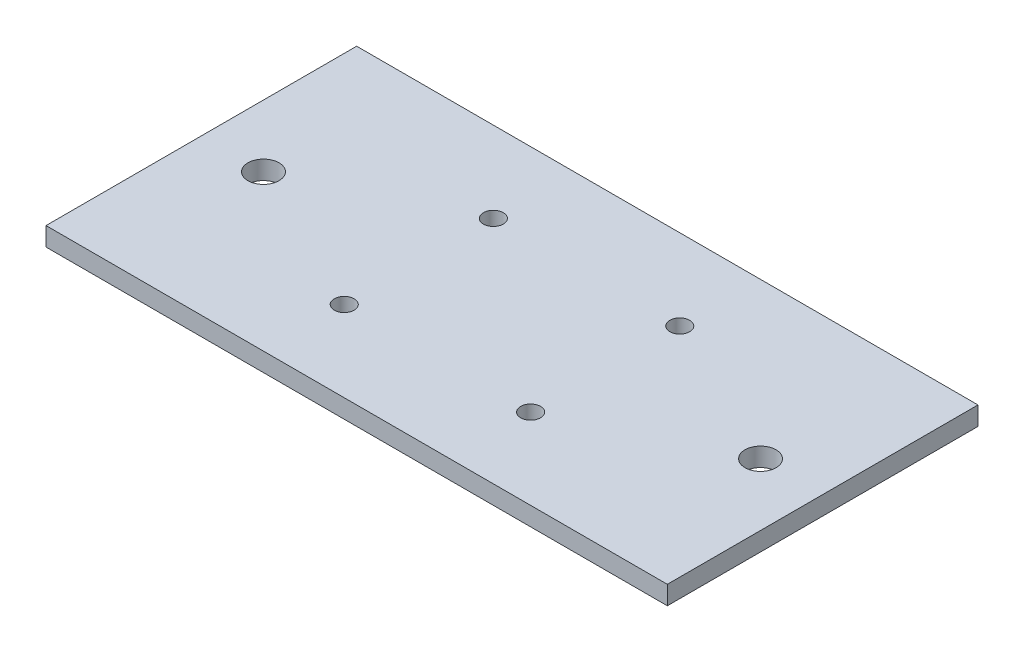
ISO-10303-21;
HEADER;
FILE_DESCRIPTION(('STEP AP214'),'2;1');
FILE_NAME('part.step','',(''),(''),'','','');
FILE_SCHEMA(('AUTOMOTIVE_DESIGN { 1 0 10303 214 1 1 1 1 }'));
ENDSEC;
DATA;
#1=APPLICATION_CONTEXT('core data for automotive mechanical design processes');
#2=APPLICATION_PROTOCOL_DEFINITION('international standard','automotive_design',2000,#1);
#3=PRODUCT_CONTEXT('',#1,'mechanical');
#4=PRODUCT('Part','Part','',(#3));
#5=PRODUCT_RELATED_PRODUCT_CATEGORY('part','',(#4));
#6=PRODUCT_DEFINITION_FORMATION('','',#4);
#7=PRODUCT_DEFINITION_CONTEXT('part definition',#1,'design');
#8=PRODUCT_DEFINITION('design','',#6,#7);
#9=PRODUCT_DEFINITION_SHAPE('','',#8);
#10=(LENGTH_UNIT() NAMED_UNIT(*) SI_UNIT(.MILLI.,.METRE.));
#11=(NAMED_UNIT(*) PLANE_ANGLE_UNIT() SI_UNIT($,.RADIAN.));
#12=(NAMED_UNIT(*) SI_UNIT($,.STERADIAN.) SOLID_ANGLE_UNIT());
#13=UNCERTAINTY_MEASURE_WITH_UNIT(LENGTH_MEASURE(1.E-05),#10,'distance_accuracy_value','');
#14=(GEOMETRIC_REPRESENTATION_CONTEXT(3) GLOBAL_UNCERTAINTY_ASSIGNED_CONTEXT((#13)) GLOBAL_UNIT_ASSIGNED_CONTEXT((#10,
#11,#12)) REPRESENTATION_CONTEXT('',''));
#15=CARTESIAN_POINT('',(0.,0.,0.));
#16=DIRECTION('',(0.,0.,1.));
#17=DIRECTION('',(1.,0.,0.));
#18=AXIS2_PLACEMENT_3D('',#15,#16,#17);
#19=CARTESIAN_POINT('',(50.,3.,-25.));
#20=DIRECTION('',(-1.,0.,0.));
#21=DIRECTION('',(0.,0.,1.));
#22=AXIS2_PLACEMENT_3D('',#19,#20,#21);
#23=PLANE('',#22);
#24=DIRECTION('',(0.,0.,-1.));
#25=VECTOR('',#24,1.);
#26=CARTESIAN_POINT('',(50.,0.,-25.));
#27=LINE('',#26,#25);
#28=CARTESIAN_POINT('',(50.,0.,25.));
#29=VERTEX_POINT('',#28);
#30=CARTESIAN_POINT('',(50.,0.,-25.));
#31=VERTEX_POINT('',#30);
#32=EDGE_CURVE('E195',#29,#31,#27,.T.);
#33=ORIENTED_EDGE('',*,*,#32,.T.);
#34=DIRECTION('',(0.,-1.,0.));
#35=VECTOR('',#34,1.);
#36=CARTESIAN_POINT('',(50.,3.,-25.));
#37=LINE('',#36,#35);
#38=CARTESIAN_POINT('',(50.,3.,-25.));
#39=VERTEX_POINT('',#38);
#40=EDGE_CURVE('E12',#39,#31,#37,.T.);
#41=ORIENTED_EDGE('',*,*,#40,.F.);
#42=DIRECTION('',(0.,0.,-1.));
#43=VECTOR('',#42,1.);
#44=CARTESIAN_POINT('',(50.,3.,-25.));
#45=LINE('',#44,#43);
#46=CARTESIAN_POINT('',(50.,3.,25.));
#47=VERTEX_POINT('',#46);
#48=EDGE_CURVE('E89',#47,#39,#45,.T.);
#49=ORIENTED_EDGE('',*,*,#48,.F.);
#50=DIRECTION('',(0.,-1.,0.));
#51=VECTOR('',#50,1.);
#52=CARTESIAN_POINT('',(50.,3.,25.));
#53=LINE('',#52,#51);
#54=EDGE_CURVE('E100',#47,#29,#53,.T.);
#55=ORIENTED_EDGE('',*,*,#54,.T.);
#56=EDGE_LOOP('',(#33,#41,#49,#55));
#57=FACE_BOUND('',#56,.T.);
#58=ADVANCED_FACE('F38',(#57),#23,.F.);
#59=CARTESIAN_POINT('',(-50.,3.,-25.));
#60=DIRECTION('',(0.,0.,1.));
#61=DIRECTION('',(1.,0.,0.));
#62=AXIS2_PLACEMENT_3D('',#59,#60,#61);
#63=PLANE('',#62);
#64=DIRECTION('',(-1.,0.,0.));
#65=VECTOR('',#64,1.);
#66=CARTESIAN_POINT('',(-50.,0.,-25.));
#67=LINE('',#66,#65);
#68=CARTESIAN_POINT('',(-50.,0.,-25.));
#69=VERTEX_POINT('',#68);
#70=EDGE_CURVE('E94',#31,#69,#67,.T.);
#71=ORIENTED_EDGE('',*,*,#70,.T.);
#72=DIRECTION('',(0.,-1.,0.));
#73=VECTOR('',#72,1.);
#74=CARTESIAN_POINT('',(-50.,3.,-25.));
#75=LINE('',#74,#73);
#76=CARTESIAN_POINT('',(-50.,3.,-25.));
#77=VERTEX_POINT('',#76);
#78=EDGE_CURVE('E46',#77,#69,#75,.T.);
#79=ORIENTED_EDGE('',*,*,#78,.F.);
#80=DIRECTION('',(-1.,0.,0.));
#81=VECTOR('',#80,1.);
#82=CARTESIAN_POINT('',(-50.,3.,-25.));
#83=LINE('',#82,#81);
#84=EDGE_CURVE('E84',#39,#77,#83,.T.);
#85=ORIENTED_EDGE('',*,*,#84,.F.);
#86=ORIENTED_EDGE('',*,*,#40,.T.);
#87=EDGE_LOOP('',(#71,#79,#85,#86));
#88=FACE_BOUND('',#87,.T.);
#89=ADVANCED_FACE('F93',(#88),#63,.F.);
#90=CARTESIAN_POINT('',(-50.,3.,-25.));
#91=DIRECTION('',(1.,0.,0.));
#92=DIRECTION('',(0.,0.,-1.));
#93=AXIS2_PLACEMENT_3D('',#90,#91,#92);
#94=PLANE('',#93);
#95=DIRECTION('',(0.,0.,1.));
#96=VECTOR('',#95,1.);
#97=CARTESIAN_POINT('',(-50.,0.,-25.));
#98=LINE('',#97,#96);
#99=CARTESIAN_POINT('',(-50.,0.,25.));
#100=VERTEX_POINT('',#99);
#101=EDGE_CURVE('E71',#69,#100,#98,.T.);
#102=ORIENTED_EDGE('',*,*,#101,.T.);
#103=DIRECTION('',(0.,-1.,0.));
#104=VECTOR('',#103,1.);
#105=CARTESIAN_POINT('',(-50.,3.,25.));
#106=LINE('',#105,#104);
#107=CARTESIAN_POINT('',(-50.,3.,25.));
#108=VERTEX_POINT('',#107);
#109=EDGE_CURVE('E95',#108,#100,#106,.T.);
#110=ORIENTED_EDGE('',*,*,#109,.F.);
#111=DIRECTION('',(0.,0.,1.));
#112=VECTOR('',#111,1.);
#113=CARTESIAN_POINT('',(-50.,3.,-25.));
#114=LINE('',#113,#112);
#115=EDGE_CURVE('E87',#77,#108,#114,.T.);
#116=ORIENTED_EDGE('',*,*,#115,.F.);
#117=ORIENTED_EDGE('',*,*,#78,.T.);
#118=EDGE_LOOP('',(#102,#110,#116,#117));
#119=FACE_BOUND('',#118,.T.);
#120=ADVANCED_FACE('F96',(#119),#94,.F.);
#121=CARTESIAN_POINT('',(-50.,3.,25.));
#122=DIRECTION('',(0.,0.,-1.));
#123=DIRECTION('',(-1.,0.,0.));
#124=AXIS2_PLACEMENT_3D('',#121,#122,#123);
#125=PLANE('',#124);
#126=DIRECTION('',(1.,0.,0.));
#127=VECTOR('',#126,1.);
#128=CARTESIAN_POINT('',(-50.,0.,25.));
#129=LINE('',#128,#127);
#130=EDGE_CURVE('E77',#100,#29,#129,.T.);
#131=ORIENTED_EDGE('',*,*,#130,.T.);
#132=ORIENTED_EDGE('',*,*,#54,.F.);
#133=DIRECTION('',(1.,0.,0.));
#134=VECTOR('',#133,1.);
#135=CARTESIAN_POINT('',(-50.,3.,25.));
#136=LINE('',#135,#134);
#137=EDGE_CURVE('E54',#108,#47,#136,.T.);
#138=ORIENTED_EDGE('',*,*,#137,.F.);
#139=ORIENTED_EDGE('',*,*,#109,.T.);
#140=EDGE_LOOP('',(#131,#132,#138,#139));
#141=FACE_BOUND('',#140,.T.);
#142=ADVANCED_FACE('F167',(#141),#125,.F.);
#143=CARTESIAN_POINT('',(0.,3.,0.));
#144=DIRECTION('',(0.,1.,0.));
#145=DIRECTION('',(0.,0.,1.));
#146=AXIS2_PLACEMENT_3D('',#143,#144,#145);
#147=PLANE('',#146);
#148=CARTESIAN_POINT('',(-40.,3.,0.));
#149=DIRECTION('',(0.,1.,0.));
#150=DIRECTION('',(0.,0.,1.));
#151=AXIS2_PLACEMENT_3D('',#148,#149,#150);
#152=CIRCLE('',#151,2.5);
#153=CARTESIAN_POINT('',(-40.,3.,2.5));
#154=VERTEX_POINT('',#153);
#155=EDGE_CURVE('E143',#154,#154,#152,.T.);
#156=ORIENTED_EDGE('',*,*,#155,.F.);
#157=EDGE_LOOP('',(#156));
#158=FACE_BOUND('',#157,.T.);
#159=CARTESIAN_POINT('',(15.,3.,12.));
#160=DIRECTION('',(0.,1.,0.));
#161=DIRECTION('',(0.,0.,1.));
#162=AXIS2_PLACEMENT_3D('',#159,#160,#161);
#163=CIRCLE('',#162,1.6);
#164=CARTESIAN_POINT('',(15.,3.,13.6));
#165=VERTEX_POINT('',#164);
#166=EDGE_CURVE('E232',#165,#165,#163,.T.);
#167=ORIENTED_EDGE('',*,*,#166,.F.);
#168=EDGE_LOOP('',(#167));
#169=FACE_BOUND('',#168,.T.);
#170=CARTESIAN_POINT('',(40.,3.,0.));
#171=DIRECTION('',(0.,1.,0.));
#172=DIRECTION('',(0.,0.,1.));
#173=AXIS2_PLACEMENT_3D('',#170,#171,#172);
#174=CIRCLE('',#173,2.5);
#175=CARTESIAN_POINT('',(40.,3.,2.5));
#176=VERTEX_POINT('',#175);
#177=EDGE_CURVE('E144',#176,#176,#174,.T.);
#178=ORIENTED_EDGE('',*,*,#177,.F.);
#179=EDGE_LOOP('',(#178));
#180=FACE_BOUND('',#179,.T.);
#181=CARTESIAN_POINT('',(-15.,3.,-12.));
#182=DIRECTION('',(0.,1.,0.));
#183=DIRECTION('',(0.,0.,1.));
#184=AXIS2_PLACEMENT_3D('',#181,#182,#183);
#185=CIRCLE('',#184,1.6);
#186=CARTESIAN_POINT('',(-15.,3.,-10.4));
#187=VERTEX_POINT('',#186);
#188=EDGE_CURVE('E114',#187,#187,#185,.T.);
#189=ORIENTED_EDGE('',*,*,#188,.F.);
#190=EDGE_LOOP('',(#189));
#191=FACE_BOUND('',#190,.T.);
#192=CARTESIAN_POINT('',(-15.,3.,12.));
#193=DIRECTION('',(0.,1.,0.));
#194=DIRECTION('',(0.,0.,1.));
#195=AXIS2_PLACEMENT_3D('',#192,#193,#194);
#196=CIRCLE('',#195,1.6);
#197=CARTESIAN_POINT('',(-15.,3.,13.6));
#198=VERTEX_POINT('',#197);
#199=EDGE_CURVE('E126',#198,#198,#196,.T.);
#200=ORIENTED_EDGE('',*,*,#199,.F.);
#201=EDGE_LOOP('',(#200));
#202=FACE_BOUND('',#201,.T.);
#203=CARTESIAN_POINT('',(15.,3.,-12.));
#204=DIRECTION('',(0.,1.,0.));
#205=DIRECTION('',(0.,0.,1.));
#206=AXIS2_PLACEMENT_3D('',#203,#204,#205);
#207=CIRCLE('',#206,1.6);
#208=CARTESIAN_POINT('',(15.,3.,-10.4));
#209=VERTEX_POINT('',#208);
#210=EDGE_CURVE('E135',#209,#209,#207,.T.);
#211=ORIENTED_EDGE('',*,*,#210,.F.);
#212=EDGE_LOOP('',(#211));
#213=FACE_BOUND('',#212,.T.);
#214=ORIENTED_EDGE('',*,*,#48,.T.);
#215=ORIENTED_EDGE('',*,*,#84,.T.);
#216=ORIENTED_EDGE('',*,*,#115,.T.);
#217=ORIENTED_EDGE('',*,*,#137,.T.);
#218=EDGE_LOOP('',(#214,#215,#216,#217));
#219=FACE_BOUND('',#218,.T.);
#220=ADVANCED_FACE('F85',(#158,#169,#180,#191,#202,#213,#219),#147,.T.);
#221=CARTESIAN_POINT('',(0.,0.,0.));
#222=DIRECTION('',(0.,1.,0.));
#223=DIRECTION('',(0.,0.,1.));
#224=AXIS2_PLACEMENT_3D('',#221,#222,#223);
#225=PLANE('',#224);
#226=CARTESIAN_POINT('',(-40.,0.,0.));
#227=DIRECTION('',(0.,1.,0.));
#228=DIRECTION('',(0.,0.,1.));
#229=AXIS2_PLACEMENT_3D('',#226,#227,#228);
#230=CIRCLE('',#229,2.5);
#231=CARTESIAN_POINT('',(-40.,0.,2.5));
#232=VERTEX_POINT('',#231);
#233=EDGE_CURVE('E197',#232,#232,#230,.T.);
#234=ORIENTED_EDGE('',*,*,#233,.T.);
#235=EDGE_LOOP('',(#234));
#236=FACE_BOUND('',#235,.T.);
#237=CARTESIAN_POINT('',(15.,0.,12.));
#238=DIRECTION('',(0.,1.,0.));
#239=DIRECTION('',(0.,0.,1.));
#240=AXIS2_PLACEMENT_3D('',#237,#238,#239);
#241=CIRCLE('',#240,1.6);
#242=CARTESIAN_POINT('',(15.,0.,13.6));
#243=VERTEX_POINT('',#242);
#244=EDGE_CURVE('E140',#243,#243,#241,.T.);
#245=ORIENTED_EDGE('',*,*,#244,.T.);
#246=EDGE_LOOP('',(#245));
#247=FACE_BOUND('',#246,.T.);
#248=CARTESIAN_POINT('',(40.,0.,0.));
#249=DIRECTION('',(0.,1.,0.));
#250=DIRECTION('',(0.,0.,1.));
#251=AXIS2_PLACEMENT_3D('',#248,#249,#250);
#252=CIRCLE('',#251,2.5);
#253=CARTESIAN_POINT('',(40.,0.,2.5));
#254=VERTEX_POINT('',#253);
#255=EDGE_CURVE('E141',#254,#254,#252,.T.);
#256=ORIENTED_EDGE('',*,*,#255,.T.);
#257=EDGE_LOOP('',(#256));
#258=FACE_BOUND('',#257,.T.);
#259=CARTESIAN_POINT('',(-15.,0.,-12.));
#260=DIRECTION('',(0.,1.,0.));
#261=DIRECTION('',(0.,0.,1.));
#262=AXIS2_PLACEMENT_3D('',#259,#260,#261);
#263=CIRCLE('',#262,1.6);
#264=CARTESIAN_POINT('',(-15.,0.,-10.4));
#265=VERTEX_POINT('',#264);
#266=EDGE_CURVE('E119',#265,#265,#263,.T.);
#267=ORIENTED_EDGE('',*,*,#266,.T.);
#268=EDGE_LOOP('',(#267));
#269=FACE_BOUND('',#268,.T.);
#270=CARTESIAN_POINT('',(-15.,0.,12.));
#271=DIRECTION('',(0.,1.,0.));
#272=DIRECTION('',(0.,0.,1.));
#273=AXIS2_PLACEMENT_3D('',#270,#271,#272);
#274=CIRCLE('',#273,1.6);
#275=CARTESIAN_POINT('',(-15.,0.,13.6));
#276=VERTEX_POINT('',#275);
#277=EDGE_CURVE('E120',#276,#276,#274,.T.);
#278=ORIENTED_EDGE('',*,*,#277,.T.);
#279=EDGE_LOOP('',(#278));
#280=FACE_BOUND('',#279,.T.);
#281=CARTESIAN_POINT('',(15.,0.,-12.));
#282=DIRECTION('',(0.,1.,0.));
#283=DIRECTION('',(0.,0.,1.));
#284=AXIS2_PLACEMENT_3D('',#281,#282,#283);
#285=CIRCLE('',#284,1.6);
#286=CARTESIAN_POINT('',(15.,0.,-10.4));
#287=VERTEX_POINT('',#286);
#288=EDGE_CURVE('E132',#287,#287,#285,.T.);
#289=ORIENTED_EDGE('',*,*,#288,.T.);
#290=EDGE_LOOP('',(#289));
#291=FACE_BOUND('',#290,.T.);
#292=ORIENTED_EDGE('',*,*,#32,.F.);
#293=ORIENTED_EDGE('',*,*,#130,.F.);
#294=ORIENTED_EDGE('',*,*,#101,.F.);
#295=ORIENTED_EDGE('',*,*,#70,.F.);
#296=EDGE_LOOP('',(#292,#293,#294,#295));
#297=FACE_BOUND('',#296,.T.);
#298=ADVANCED_FACE('F154',(#236,#247,#258,#269,#280,#291,#297),#225,.F.);
#299=CARTESIAN_POINT('',(15.,0.,-12.));
#300=DIRECTION('',(0.,1.,0.));
#301=DIRECTION('',(0.,0.,1.));
#302=AXIS2_PLACEMENT_3D('',#299,#300,#301);
#303=CYLINDRICAL_SURFACE('',#302,1.6);
#304=ORIENTED_EDGE('',*,*,#288,.F.);
#305=EDGE_LOOP('',(#304));
#306=FACE_BOUND('',#305,.T.);
#307=ORIENTED_EDGE('',*,*,#210,.T.);
#308=EDGE_LOOP('',(#307));
#309=FACE_BOUND('',#308,.T.);
#310=ADVANCED_FACE('F174',(#306,#309),#303,.F.);
#311=CARTESIAN_POINT('',(-15.,0.,12.));
#312=DIRECTION('',(0.,1.,0.));
#313=DIRECTION('',(0.,0.,1.));
#314=AXIS2_PLACEMENT_3D('',#311,#312,#313);
#315=CYLINDRICAL_SURFACE('',#314,1.6);
#316=ORIENTED_EDGE('',*,*,#277,.F.);
#317=EDGE_LOOP('',(#316));
#318=FACE_BOUND('',#317,.T.);
#319=ORIENTED_EDGE('',*,*,#199,.T.);
#320=EDGE_LOOP('',(#319));
#321=FACE_BOUND('',#320,.T.);
#322=ADVANCED_FACE('F161',(#318,#321),#315,.F.);
#323=CARTESIAN_POINT('',(-15.,0.,-12.));
#324=DIRECTION('',(0.,1.,0.));
#325=DIRECTION('',(0.,0.,1.));
#326=AXIS2_PLACEMENT_3D('',#323,#324,#325);
#327=CYLINDRICAL_SURFACE('',#326,1.6);
#328=ORIENTED_EDGE('',*,*,#266,.F.);
#329=EDGE_LOOP('',(#328));
#330=FACE_BOUND('',#329,.T.);
#331=ORIENTED_EDGE('',*,*,#188,.T.);
#332=EDGE_LOOP('',(#331));
#333=FACE_BOUND('',#332,.T.);
#334=ADVANCED_FACE('F157',(#330,#333),#327,.F.);
#335=CARTESIAN_POINT('',(40.,0.,0.));
#336=DIRECTION('',(0.,1.,0.));
#337=DIRECTION('',(0.,0.,1.));
#338=AXIS2_PLACEMENT_3D('',#335,#336,#337);
#339=CYLINDRICAL_SURFACE('',#338,2.5);
#340=ORIENTED_EDGE('',*,*,#255,.F.);
#341=EDGE_LOOP('',(#340));
#342=FACE_BOUND('',#341,.T.);
#343=ORIENTED_EDGE('',*,*,#177,.T.);
#344=EDGE_LOOP('',(#343));
#345=FACE_BOUND('',#344,.T.);
#346=ADVANCED_FACE('F160',(#342,#345),#339,.F.);
#347=CARTESIAN_POINT('',(15.,0.,12.));
#348=DIRECTION('',(0.,1.,0.));
#349=DIRECTION('',(0.,0.,1.));
#350=AXIS2_PLACEMENT_3D('',#347,#348,#349);
#351=CYLINDRICAL_SURFACE('',#350,1.6);
#352=ORIENTED_EDGE('',*,*,#244,.F.);
#353=EDGE_LOOP('',(#352));
#354=FACE_BOUND('',#353,.T.);
#355=ORIENTED_EDGE('',*,*,#166,.T.);
#356=EDGE_LOOP('',(#355));
#357=FACE_BOUND('',#356,.T.);
#358=ADVANCED_FACE('F212',(#354,#357),#351,.F.);
#359=CARTESIAN_POINT('',(-40.,0.,0.));
#360=DIRECTION('',(0.,1.,0.));
#361=DIRECTION('',(0.,0.,1.));
#362=AXIS2_PLACEMENT_3D('',#359,#360,#361);
#363=CYLINDRICAL_SURFACE('',#362,2.5);
#364=ORIENTED_EDGE('',*,*,#233,.F.);
#365=EDGE_LOOP('',(#364));
#366=FACE_BOUND('',#365,.T.);
#367=ORIENTED_EDGE('',*,*,#155,.T.);
#368=EDGE_LOOP('',(#367));
#369=FACE_BOUND('',#368,.T.);
#370=ADVANCED_FACE('F217',(#366,#369),#363,.F.);
#371=CLOSED_SHELL('',(#58,#89,#120,#142,#220,#298,#310,#322,#334,#346,#358,#370));
#372=MANIFOLD_SOLID_BREP('B2',#371);
#373=ADVANCED_BREP_SHAPE_REPRESENTATION('',(#18,#372),#14);
#374=SHAPE_DEFINITION_REPRESENTATION(#9,#373);
ENDSEC;
END-ISO-10303-21;
